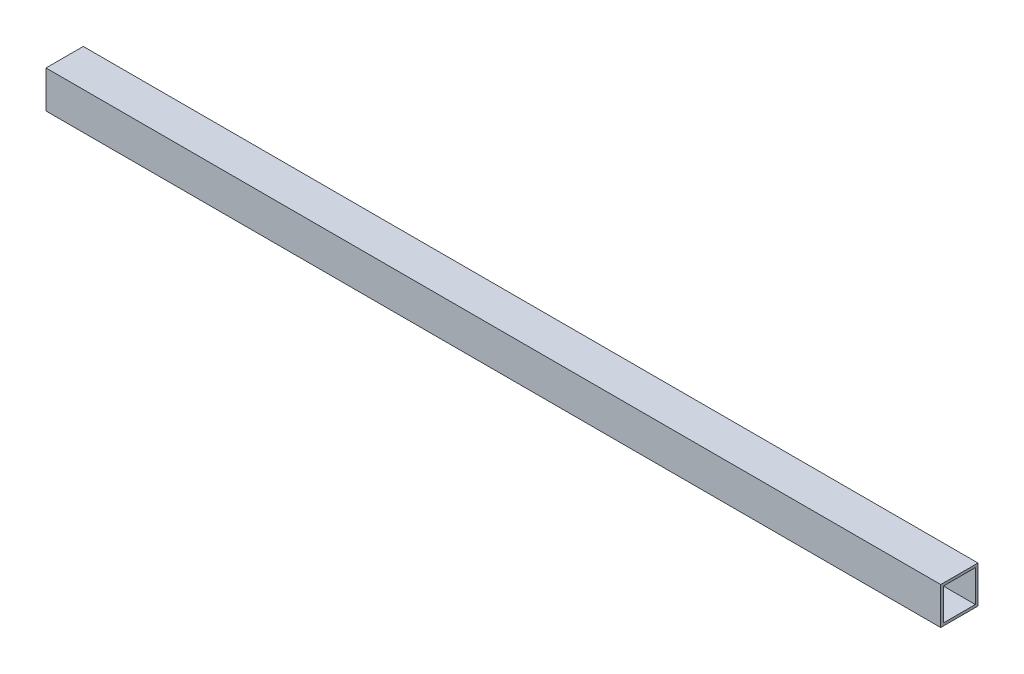
ISO-10303-21;
HEADER;
FILE_DESCRIPTION(('STEP AP214'),'2;1');
FILE_NAME('part.step','',(''),(''),'','','');
FILE_SCHEMA(('AUTOMOTIVE_DESIGN { 1 0 10303 214 1 1 1 1 }'));
ENDSEC;
DATA;
#1=APPLICATION_CONTEXT('core data for automotive mechanical design processes');
#2=APPLICATION_PROTOCOL_DEFINITION('international standard','automotive_design',2000,#1);
#3=PRODUCT_CONTEXT('',#1,'mechanical');
#4=PRODUCT('Part','Part','',(#3));
#5=PRODUCT_RELATED_PRODUCT_CATEGORY('part','',(#4));
#6=PRODUCT_DEFINITION_FORMATION('','',#4);
#7=PRODUCT_DEFINITION_CONTEXT('part definition',#1,'design');
#8=PRODUCT_DEFINITION('design','',#6,#7);
#9=PRODUCT_DEFINITION_SHAPE('','',#8);
#10=(LENGTH_UNIT() NAMED_UNIT(*) SI_UNIT(.MILLI.,.METRE.));
#11=(NAMED_UNIT(*) PLANE_ANGLE_UNIT() SI_UNIT($,.RADIAN.));
#12=(NAMED_UNIT(*) SI_UNIT($,.STERADIAN.) SOLID_ANGLE_UNIT());
#13=UNCERTAINTY_MEASURE_WITH_UNIT(LENGTH_MEASURE(1.E-05),#10,'distance_accuracy_value','');
#14=(GEOMETRIC_REPRESENTATION_CONTEXT(3) GLOBAL_UNCERTAINTY_ASSIGNED_CONTEXT((#13)) GLOBAL_UNIT_ASSIGNED_CONTEXT((#10,
#11,#12)) REPRESENTATION_CONTEXT('',''));
#15=CARTESIAN_POINT('',(0.,0.,0.));
#16=DIRECTION('',(0.,0.,1.));
#17=DIRECTION('',(1.,0.,0.));
#18=AXIS2_PLACEMENT_3D('',#15,#16,#17);
#19=CARTESIAN_POINT('',(1066.8,0.,0.));
#20=DIRECTION('',(-1.,0.,0.));
#21=DIRECTION('',(0.,0.,1.));
#22=AXIS2_PLACEMENT_3D('',#19,#20,#21);
#23=PLANE('',#22);
#24=DIRECTION('',(0.,-1.,0.));
#25=VECTOR('',#24,1.);
#26=CARTESIAN_POINT('',(1066.8,0.,0.));
#27=LINE('',#26,#25);
#28=CARTESIAN_POINT('',(1066.8,44.45,0.));
#29=VERTEX_POINT('',#28);
#30=CARTESIAN_POINT('',(1066.8,0.,0.));
#31=VERTEX_POINT('',#30);
#32=EDGE_CURVE('E138',#29,#31,#27,.T.);
#33=ORIENTED_EDGE('',*,*,#32,.T.);
#34=DIRECTION('',(0.,0.,-1.));
#35=VECTOR('',#34,1.);
#36=CARTESIAN_POINT('',(1066.8,0.,0.));
#37=LINE('',#36,#35);
#38=CARTESIAN_POINT('',(1066.8,0.,-44.45));
#39=VERTEX_POINT('',#38);
#40=EDGE_CURVE('E141',#31,#39,#37,.T.);
#41=ORIENTED_EDGE('',*,*,#40,.T.);
#42=DIRECTION('',(0.,1.,0.));
#43=VECTOR('',#42,1.);
#44=CARTESIAN_POINT('',(1066.8,0.,-44.45));
#45=LINE('',#44,#43);
#46=CARTESIAN_POINT('',(1066.8,44.45,-44.45));
#47=VERTEX_POINT('',#46);
#48=EDGE_CURVE('E144',#39,#47,#45,.T.);
#49=ORIENTED_EDGE('',*,*,#48,.T.);
#50=DIRECTION('',(0.,0.,1.));
#51=VECTOR('',#50,1.);
#52=CARTESIAN_POINT('',(1066.8,44.45,0.));
#53=LINE('',#52,#51);
#54=EDGE_CURVE('E146',#47,#29,#53,.T.);
#55=ORIENTED_EDGE('',*,*,#54,.T.);
#56=EDGE_LOOP('',(#33,#41,#49,#55));
#57=FACE_BOUND('',#56,.T.);
#58=DIRECTION('',(0.,-1.,0.));
#59=VECTOR('',#58,1.);
#60=CARTESIAN_POINT('',(1066.8,3.175,-3.175));
#61=LINE('',#60,#59);
#62=CARTESIAN_POINT('',(1066.8,41.275,-3.175));
#63=VERTEX_POINT('',#62);
#64=CARTESIAN_POINT('',(1066.8,3.175,-3.175));
#65=VERTEX_POINT('',#64);
#66=EDGE_CURVE('E102',#63,#65,#61,.T.);
#67=ORIENTED_EDGE('',*,*,#66,.F.);
#68=DIRECTION('',(0.,0.,1.));
#69=VECTOR('',#68,1.);
#70=CARTESIAN_POINT('',(1066.8,41.275,-3.175));
#71=LINE('',#70,#69);
#72=CARTESIAN_POINT('',(1066.8,41.275,-41.275));
#73=VERTEX_POINT('',#72);
#74=EDGE_CURVE('E124',#73,#63,#71,.T.);
#75=ORIENTED_EDGE('',*,*,#74,.F.);
#76=DIRECTION('',(0.,1.,0.));
#77=VECTOR('',#76,1.);
#78=CARTESIAN_POINT('',(1066.8,3.175,-41.275));
#79=LINE('',#78,#77);
#80=CARTESIAN_POINT('',(1066.8,3.175,-41.275));
#81=VERTEX_POINT('',#80);
#82=EDGE_CURVE('E122',#81,#73,#79,.T.);
#83=ORIENTED_EDGE('',*,*,#82,.F.);
#84=DIRECTION('',(0.,0.,-1.));
#85=VECTOR('',#84,1.);
#86=CARTESIAN_POINT('',(1066.8,3.175,-3.175));
#87=LINE('',#86,#85);
#88=EDGE_CURVE('E110',#65,#81,#87,.T.);
#89=ORIENTED_EDGE('',*,*,#88,.F.);
#90=EDGE_LOOP('',(#67,#75,#83,#89));
#91=FACE_BOUND('',#90,.T.);
#92=ADVANCED_FACE('F37',(#57,#91),#23,.F.);
#93=CARTESIAN_POINT('',(0.,0.,0.));
#94=DIRECTION('',(-1.,0.,0.));
#95=DIRECTION('',(0.,0.,1.));
#96=AXIS2_PLACEMENT_3D('',#93,#94,#95);
#97=PLANE('',#96);
#98=DIRECTION('',(0.,-1.,0.));
#99=VECTOR('',#98,1.);
#100=CARTESIAN_POINT('',(0.,0.,0.));
#101=LINE('',#100,#99);
#102=CARTESIAN_POINT('',(0.,44.45,0.));
#103=VERTEX_POINT('',#102);
#104=CARTESIAN_POINT('',(0.,0.,0.));
#105=VERTEX_POINT('',#104);
#106=EDGE_CURVE('E118',#103,#105,#101,.T.);
#107=ORIENTED_EDGE('',*,*,#106,.F.);
#108=DIRECTION('',(0.,0.,1.));
#109=VECTOR('',#108,1.);
#110=CARTESIAN_POINT('',(0.,44.45,0.));
#111=LINE('',#110,#109);
#112=CARTESIAN_POINT('',(0.,44.45,-44.45));
#113=VERTEX_POINT('',#112);
#114=EDGE_CURVE('E142',#113,#103,#111,.T.);
#115=ORIENTED_EDGE('',*,*,#114,.F.);
#116=DIRECTION('',(0.,1.,0.));
#117=VECTOR('',#116,1.);
#118=CARTESIAN_POINT('',(0.,0.,-44.45));
#119=LINE('',#118,#117);
#120=CARTESIAN_POINT('',(0.,0.,-44.45));
#121=VERTEX_POINT('',#120);
#122=EDGE_CURVE('E153',#121,#113,#119,.T.);
#123=ORIENTED_EDGE('',*,*,#122,.F.);
#124=DIRECTION('',(0.,0.,-1.));
#125=VECTOR('',#124,1.);
#126=CARTESIAN_POINT('',(0.,0.,0.));
#127=LINE('',#126,#125);
#128=EDGE_CURVE('E151',#105,#121,#127,.T.);
#129=ORIENTED_EDGE('',*,*,#128,.F.);
#130=EDGE_LOOP('',(#107,#115,#123,#129));
#131=FACE_BOUND('',#130,.T.);
#132=DIRECTION('',(0.,0.,1.));
#133=VECTOR('',#132,1.);
#134=CARTESIAN_POINT('',(0.,41.275,-3.175));
#135=LINE('',#134,#133);
#136=CARTESIAN_POINT('',(0.,41.275,-41.275));
#137=VERTEX_POINT('',#136);
#138=CARTESIAN_POINT('',(0.,41.275,-3.175));
#139=VERTEX_POINT('',#138);
#140=EDGE_CURVE('E111',#137,#139,#135,.T.);
#141=ORIENTED_EDGE('',*,*,#140,.T.);
#142=DIRECTION('',(0.,-1.,0.));
#143=VECTOR('',#142,1.);
#144=CARTESIAN_POINT('',(0.,3.175,-3.175));
#145=LINE('',#144,#143);
#146=CARTESIAN_POINT('',(0.,3.175,-3.175));
#147=VERTEX_POINT('',#146);
#148=EDGE_CURVE('E60',#139,#147,#145,.T.);
#149=ORIENTED_EDGE('',*,*,#148,.T.);
#150=DIRECTION('',(0.,0.,-1.));
#151=VECTOR('',#150,1.);
#152=CARTESIAN_POINT('',(0.,3.175,-3.175));
#153=LINE('',#152,#151);
#154=CARTESIAN_POINT('',(0.,3.175,-41.275));
#155=VERTEX_POINT('',#154);
#156=EDGE_CURVE('E117',#147,#155,#153,.T.);
#157=ORIENTED_EDGE('',*,*,#156,.T.);
#158=DIRECTION('',(0.,1.,0.));
#159=VECTOR('',#158,1.);
#160=CARTESIAN_POINT('',(0.,3.175,-41.275));
#161=LINE('',#160,#159);
#162=EDGE_CURVE('E130',#155,#137,#161,.T.);
#163=ORIENTED_EDGE('',*,*,#162,.T.);
#164=EDGE_LOOP('',(#141,#149,#157,#163));
#165=FACE_BOUND('',#164,.T.);
#166=ADVANCED_FACE('F171',(#131,#165),#97,.T.);
#167=CARTESIAN_POINT('',(1066.8,0.,0.));
#168=DIRECTION('',(0.,0.,-1.));
#169=DIRECTION('',(-1.,0.,0.));
#170=AXIS2_PLACEMENT_3D('',#167,#168,#169);
#171=PLANE('',#170);
#172=ORIENTED_EDGE('',*,*,#106,.T.);
#173=DIRECTION('',(-1.,0.,0.));
#174=VECTOR('',#173,1.);
#175=CARTESIAN_POINT('',(1066.8,0.,0.));
#176=LINE('',#175,#174);
#177=EDGE_CURVE('E11',#31,#105,#176,.T.);
#178=ORIENTED_EDGE('',*,*,#177,.F.);
#179=ORIENTED_EDGE('',*,*,#32,.F.);
#180=DIRECTION('',(-1.,0.,0.));
#181=VECTOR('',#180,1.);
#182=CARTESIAN_POINT('',(1066.8,44.45,0.));
#183=LINE('',#182,#181);
#184=EDGE_CURVE('E148',#29,#103,#183,.T.);
#185=ORIENTED_EDGE('',*,*,#184,.T.);
#186=EDGE_LOOP('',(#172,#178,#179,#185));
#187=FACE_BOUND('',#186,.T.);
#188=ADVANCED_FACE('F39',(#187),#171,.F.);
#189=CARTESIAN_POINT('',(1066.8,0.,0.));
#190=DIRECTION('',(0.,1.,0.));
#191=DIRECTION('',(0.,0.,1.));
#192=AXIS2_PLACEMENT_3D('',#189,#190,#191);
#193=PLANE('',#192);
#194=ORIENTED_EDGE('',*,*,#128,.T.);
#195=DIRECTION('',(-1.,0.,0.));
#196=VECTOR('',#195,1.);
#197=CARTESIAN_POINT('',(1066.8,0.,-44.45));
#198=LINE('',#197,#196);
#199=EDGE_CURVE('E45',#39,#121,#198,.T.);
#200=ORIENTED_EDGE('',*,*,#199,.F.);
#201=ORIENTED_EDGE('',*,*,#40,.F.);
#202=ORIENTED_EDGE('',*,*,#177,.T.);
#203=EDGE_LOOP('',(#194,#200,#201,#202));
#204=FACE_BOUND('',#203,.T.);
#205=ADVANCED_FACE('F181',(#204),#193,.F.);
#206=CARTESIAN_POINT('',(1066.8,0.,-44.45));
#207=DIRECTION('',(0.,0.,1.));
#208=DIRECTION('',(1.,0.,0.));
#209=AXIS2_PLACEMENT_3D('',#206,#207,#208);
#210=PLANE('',#209);
#211=ORIENTED_EDGE('',*,*,#122,.T.);
#212=DIRECTION('',(-1.,0.,0.));
#213=VECTOR('',#212,1.);
#214=CARTESIAN_POINT('',(1066.8,44.45,-44.45));
#215=LINE('',#214,#213);
#216=EDGE_CURVE('E158',#47,#113,#215,.T.);
#217=ORIENTED_EDGE('',*,*,#216,.F.);
#218=ORIENTED_EDGE('',*,*,#48,.F.);
#219=ORIENTED_EDGE('',*,*,#199,.T.);
#220=EDGE_LOOP('',(#211,#217,#218,#219));
#221=FACE_BOUND('',#220,.T.);
#222=ADVANCED_FACE('F165',(#221),#210,.F.);
#223=CARTESIAN_POINT('',(1066.8,44.45,0.));
#224=DIRECTION('',(0.,-1.,0.));
#225=DIRECTION('',(0.,0.,-1.));
#226=AXIS2_PLACEMENT_3D('',#223,#224,#225);
#227=PLANE('',#226);
#228=ORIENTED_EDGE('',*,*,#114,.T.);
#229=ORIENTED_EDGE('',*,*,#184,.F.);
#230=ORIENTED_EDGE('',*,*,#54,.F.);
#231=ORIENTED_EDGE('',*,*,#216,.T.);
#232=EDGE_LOOP('',(#228,#229,#230,#231));
#233=FACE_BOUND('',#232,.T.);
#234=ADVANCED_FACE('F175',(#233),#227,.F.);
#235=CARTESIAN_POINT('',(1066.8,3.175,-3.175));
#236=DIRECTION('',(0.,0.,-1.));
#237=DIRECTION('',(-1.,0.,0.));
#238=AXIS2_PLACEMENT_3D('',#235,#236,#237);
#239=PLANE('',#238);
#240=ORIENTED_EDGE('',*,*,#148,.F.);
#241=DIRECTION('',(-1.,0.,0.));
#242=VECTOR('',#241,1.);
#243=CARTESIAN_POINT('',(1066.8,41.275,-3.175));
#244=LINE('',#243,#242);
#245=EDGE_CURVE('E106',#63,#139,#244,.T.);
#246=ORIENTED_EDGE('',*,*,#245,.F.);
#247=ORIENTED_EDGE('',*,*,#66,.T.);
#248=DIRECTION('',(-1.,0.,0.));
#249=VECTOR('',#248,1.);
#250=CARTESIAN_POINT('',(1066.8,3.175,-3.175));
#251=LINE('',#250,#249);
#252=EDGE_CURVE('E105',#65,#147,#251,.T.);
#253=ORIENTED_EDGE('',*,*,#252,.T.);
#254=EDGE_LOOP('',(#240,#246,#247,#253));
#255=FACE_BOUND('',#254,.T.);
#256=ADVANCED_FACE('F104',(#255),#239,.T.);
#257=CARTESIAN_POINT('',(1066.8,3.175,-3.175));
#258=DIRECTION('',(0.,1.,0.));
#259=DIRECTION('',(0.,0.,1.));
#260=AXIS2_PLACEMENT_3D('',#257,#258,#259);
#261=PLANE('',#260);
#262=ORIENTED_EDGE('',*,*,#156,.F.);
#263=ORIENTED_EDGE('',*,*,#252,.F.);
#264=ORIENTED_EDGE('',*,*,#88,.T.);
#265=DIRECTION('',(-1.,0.,0.));
#266=VECTOR('',#265,1.);
#267=CARTESIAN_POINT('',(1066.8,3.175,-41.275));
#268=LINE('',#267,#266);
#269=EDGE_CURVE('E119',#81,#155,#268,.T.);
#270=ORIENTED_EDGE('',*,*,#269,.T.);
#271=EDGE_LOOP('',(#262,#263,#264,#270));
#272=FACE_BOUND('',#271,.T.);
#273=ADVANCED_FACE('F114',(#272),#261,.T.);
#274=CARTESIAN_POINT('',(1066.8,3.175,-41.275));
#275=DIRECTION('',(0.,0.,1.));
#276=DIRECTION('',(1.,0.,0.));
#277=AXIS2_PLACEMENT_3D('',#274,#275,#276);
#278=PLANE('',#277);
#279=ORIENTED_EDGE('',*,*,#162,.F.);
#280=ORIENTED_EDGE('',*,*,#269,.F.);
#281=ORIENTED_EDGE('',*,*,#82,.T.);
#282=DIRECTION('',(-1.,0.,0.));
#283=VECTOR('',#282,1.);
#284=CARTESIAN_POINT('',(1066.8,41.275,-41.275));
#285=LINE('',#284,#283);
#286=EDGE_CURVE('E52',#73,#137,#285,.T.);
#287=ORIENTED_EDGE('',*,*,#286,.T.);
#288=EDGE_LOOP('',(#279,#280,#281,#287));
#289=FACE_BOUND('',#288,.T.);
#290=ADVANCED_FACE('F204',(#289),#278,.T.);
#291=CARTESIAN_POINT('',(1066.8,41.275,-3.175));
#292=DIRECTION('',(0.,-1.,0.));
#293=DIRECTION('',(0.,0.,-1.));
#294=AXIS2_PLACEMENT_3D('',#291,#292,#293);
#295=PLANE('',#294);
#296=ORIENTED_EDGE('',*,*,#140,.F.);
#297=ORIENTED_EDGE('',*,*,#286,.F.);
#298=ORIENTED_EDGE('',*,*,#74,.T.);
#299=ORIENTED_EDGE('',*,*,#245,.T.);
#300=EDGE_LOOP('',(#296,#297,#298,#299));
#301=FACE_BOUND('',#300,.T.);
#302=ADVANCED_FACE('F208',(#301),#295,.T.);
#303=CLOSED_SHELL('',(#92,#166,#188,#205,#222,#234,#256,#273,#290,#302));
#304=MANIFOLD_SOLID_BREP('B2',#303);
#305=ADVANCED_BREP_SHAPE_REPRESENTATION('',(#18,#304),#14);
#306=SHAPE_DEFINITION_REPRESENTATION(#9,#305);
ENDSEC;
END-ISO-10303-21;
